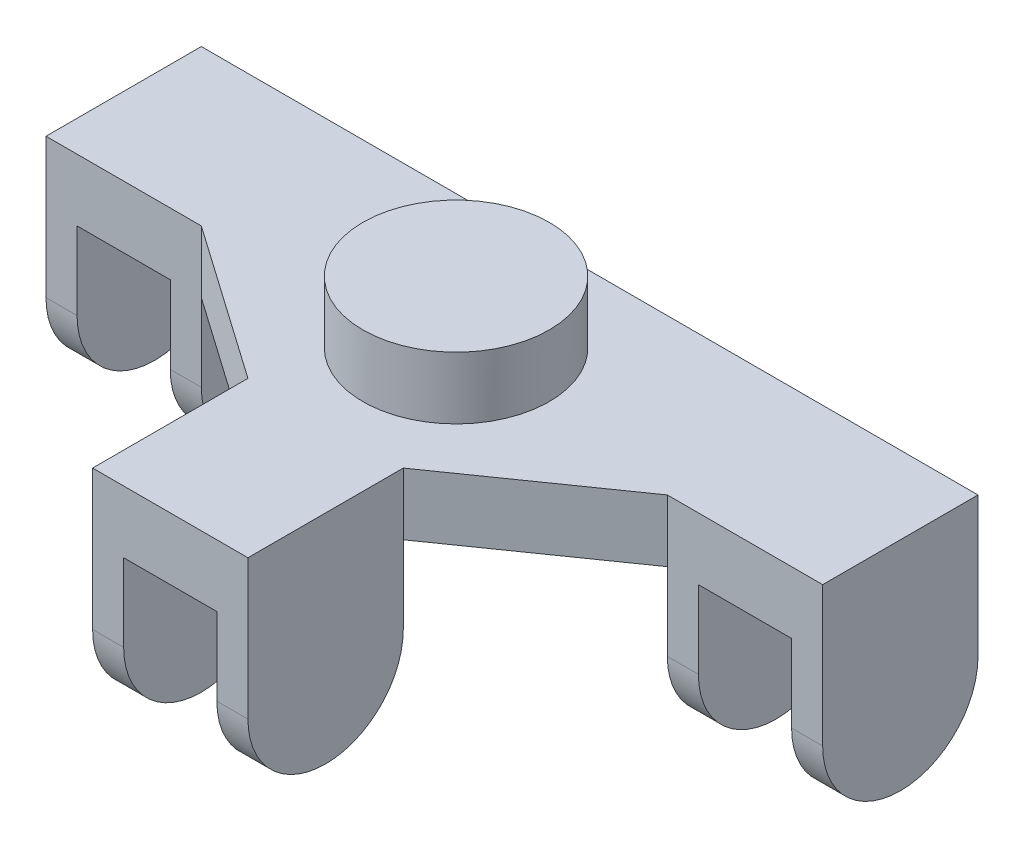
ISO-10303-21;
HEADER;
FILE_DESCRIPTION(('STEP AP214'),'2;1');
FILE_NAME('part.step','',(''),(''),'','','');
FILE_SCHEMA(('AUTOMOTIVE_DESIGN { 1 0 10303 214 1 1 1 1 }'));
ENDSEC;
DATA;
#1=APPLICATION_CONTEXT('core data for automotive mechanical design processes');
#2=APPLICATION_PROTOCOL_DEFINITION('international standard','automotive_design',2000,#1);
#3=PRODUCT_CONTEXT('',#1,'mechanical');
#4=PRODUCT('Part','Part','',(#3));
#5=PRODUCT_RELATED_PRODUCT_CATEGORY('part','',(#4));
#6=PRODUCT_DEFINITION_FORMATION('','',#4);
#7=PRODUCT_DEFINITION_CONTEXT('part definition',#1,'design');
#8=PRODUCT_DEFINITION('design','',#6,#7);
#9=PRODUCT_DEFINITION_SHAPE('','',#8);
#10=(LENGTH_UNIT() NAMED_UNIT(*) SI_UNIT(.MILLI.,.METRE.));
#11=(NAMED_UNIT(*) PLANE_ANGLE_UNIT() SI_UNIT($,.RADIAN.));
#12=(NAMED_UNIT(*) SI_UNIT($,.STERADIAN.) SOLID_ANGLE_UNIT());
#13=UNCERTAINTY_MEASURE_WITH_UNIT(LENGTH_MEASURE(1.E-05),#10,'distance_accuracy_value','');
#14=(GEOMETRIC_REPRESENTATION_CONTEXT(3) GLOBAL_UNCERTAINTY_ASSIGNED_CONTEXT((#13)) GLOBAL_UNIT_ASSIGNED_CONTEXT((#10,
#11,#12)) REPRESENTATION_CONTEXT('',''));
#15=CARTESIAN_POINT('',(0.,0.,0.));
#16=DIRECTION('',(0.,0.,1.));
#17=DIRECTION('',(1.,0.,0.));
#18=AXIS2_PLACEMENT_3D('',#15,#16,#17);
#19=CARTESIAN_POINT('',(-5.,-10.,12.));
#20=DIRECTION('',(0.,0.,-1.));
#21=DIRECTION('',(-1.,0.,0.));
#22=AXIS2_PLACEMENT_3D('',#19,#20,#21);
#23=PLANE('',#22);
#24=DIRECTION('',(0.,1.,0.));
#25=VECTOR('',#24,1.);
#26=CARTESIAN_POINT('',(5.,-10.,12.));
#27=LINE('',#26,#25);
#28=CARTESIAN_POINT('',(5.,-5.,12.));
#29=VERTEX_POINT('',#28);
#30=CARTESIAN_POINT('',(5.,0.,12.));
#31=VERTEX_POINT('',#30);
#32=EDGE_CURVE('E322',#29,#31,#27,.T.);
#33=ORIENTED_EDGE('',*,*,#32,.F.);
#34=DIRECTION('',(1.,0.,0.));
#35=VECTOR('',#34,1.);
#36=CARTESIAN_POINT('',(-25.,-5.,12.));
#37=LINE('',#36,#35);
#38=CARTESIAN_POINT('',(3.,-5.,12.));
#39=VERTEX_POINT('',#38);
#40=EDGE_CURVE('E286',#39,#29,#37,.T.);
#41=ORIENTED_EDGE('',*,*,#40,.F.);
#42=DIRECTION('',(0.,-1.,0.));
#43=VECTOR('',#42,1.);
#44=CARTESIAN_POINT('',(3.,-10.,12.));
#45=LINE('',#44,#43);
#46=CARTESIAN_POINT('',(3.,0.,12.));
#47=VERTEX_POINT('',#46);
#48=EDGE_CURVE('E292',#47,#39,#45,.T.);
#49=ORIENTED_EDGE('',*,*,#48,.F.);
#50=DIRECTION('',(-1.,0.,0.));
#51=VECTOR('',#50,1.);
#52=CARTESIAN_POINT('',(-5.,0.,12.));
#53=LINE('',#52,#51);
#54=EDGE_CURVE('E319',#31,#47,#53,.T.);
#55=ORIENTED_EDGE('',*,*,#54,.F.);
#56=EDGE_LOOP('',(#33,#41,#49,#55));
#57=FACE_BOUND('',#56,.T.);
#58=ADVANCED_FACE('F34',(#57),#23,.T.);
#59=CARTESIAN_POINT('',(-25.,4.,5.));
#60=DIRECTION('',(0.,0.,-1.));
#61=DIRECTION('',(-1.,0.,0.));
#62=AXIS2_PLACEMENT_3D('',#59,#60,#61);
#63=PLANE('',#62);
#64=DIRECTION('',(1.,0.,0.));
#65=VECTOR('',#64,1.);
#66=CARTESIAN_POINT('',(-25.,-5.,5.00000000000001));
#67=LINE('',#66,#65);
#68=CARTESIAN_POINT('',(-17.,-5.,5.));
#69=VERTEX_POINT('',#68);
#70=CARTESIAN_POINT('',(-15.,-5.,5.00000000000001));
#71=VERTEX_POINT('',#70);
#72=EDGE_CURVE('E217',#69,#71,#67,.T.);
#73=ORIENTED_EDGE('',*,*,#72,.T.);
#74=DIRECTION('',(0.,1.,0.));
#75=VECTOR('',#74,1.);
#76=CARTESIAN_POINT('',(-15.,-10.,5.));
#77=LINE('',#76,#75);
#78=CARTESIAN_POINT('',(-15.,0.,5.));
#79=VERTEX_POINT('',#78);
#80=EDGE_CURVE('E336',#71,#79,#77,.T.);
#81=ORIENTED_EDGE('',*,*,#80,.T.);
#82=DIRECTION('',(0.,-1.,0.));
#83=VECTOR('',#82,1.);
#84=CARTESIAN_POINT('',(-15.,4.,5.));
#85=LINE('',#84,#83);
#86=CARTESIAN_POINT('',(-15.,4.,5.));
#87=VERTEX_POINT('',#86);
#88=EDGE_CURVE('E264',#87,#79,#85,.T.);
#89=ORIENTED_EDGE('',*,*,#88,.F.);
#90=DIRECTION('',(1.,0.,0.));
#91=VECTOR('',#90,1.);
#92=CARTESIAN_POINT('',(-25.,4.,5.));
#93=LINE('',#92,#91);
#94=CARTESIAN_POINT('',(-25.,4.,5.));
#95=VERTEX_POINT('',#94);
#96=EDGE_CURVE('E233',#95,#87,#93,.T.);
#97=ORIENTED_EDGE('',*,*,#96,.F.);
#98=DIRECTION('',(0.,-1.,0.));
#99=VECTOR('',#98,1.);
#100=CARTESIAN_POINT('',(-25.,4.,5.));
#101=LINE('',#100,#99);
#102=CARTESIAN_POINT('',(-25.,-5.,5.00000000000001));
#103=VERTEX_POINT('',#102);
#104=EDGE_CURVE('E224',#95,#103,#101,.T.);
#105=ORIENTED_EDGE('',*,*,#104,.T.);
#106=CARTESIAN_POINT('',(-23.,-5.,5.00000000000001));
#107=VERTEX_POINT('',#106);
#108=EDGE_CURVE('E206',#103,#107,#67,.T.);
#109=ORIENTED_EDGE('',*,*,#108,.T.);
#110=DIRECTION('',(0.,1.,0.));
#111=VECTOR('',#110,1.);
#112=CARTESIAN_POINT('',(-23.,4.,5.));
#113=LINE('',#112,#111);
#114=CARTESIAN_POINT('',(-23.,0.,5.));
#115=VERTEX_POINT('',#114);
#116=EDGE_CURVE('E308',#107,#115,#113,.T.);
#117=ORIENTED_EDGE('',*,*,#116,.T.);
#118=DIRECTION('',(1.,0.,0.));
#119=VECTOR('',#118,1.);
#120=CARTESIAN_POINT('',(-25.,0.,5.));
#121=LINE('',#120,#119);
#122=CARTESIAN_POINT('',(-17.,0.,5.));
#123=VERTEX_POINT('',#122);
#124=EDGE_CURVE('E313',#115,#123,#121,.T.);
#125=ORIENTED_EDGE('',*,*,#124,.T.);
#126=DIRECTION('',(0.,-1.,0.));
#127=VECTOR('',#126,1.);
#128=CARTESIAN_POINT('',(-17.,4.,5.));
#129=LINE('',#128,#127);
#130=EDGE_CURVE('E310',#123,#69,#129,.T.);
#131=ORIENTED_EDGE('',*,*,#130,.T.);
#132=EDGE_LOOP('',(#73,#81,#89,#97,#105,#109,#117,#125,#131));
#133=FACE_BOUND('',#132,.T.);
#134=ADVANCED_FACE('F36',(#133),#63,.F.);
#135=CARTESIAN_POINT('',(-5.,4.,22.));
#136=DIRECTION('',(0.,0.,-1.));
#137=DIRECTION('',(-1.,0.,0.));
#138=AXIS2_PLACEMENT_3D('',#135,#136,#137);
#139=PLANE('',#138);
#140=DIRECTION('',(1.,0.,0.));
#141=VECTOR('',#140,1.);
#142=CARTESIAN_POINT('',(-25.,-5.,22.));
#143=LINE('',#142,#141);
#144=CARTESIAN_POINT('',(3.,-5.,22.));
#145=VERTEX_POINT('',#144);
#146=CARTESIAN_POINT('',(5.,-5.,22.));
#147=VERTEX_POINT('',#146);
#148=EDGE_CURVE('E49',#145,#147,#143,.T.);
#149=ORIENTED_EDGE('',*,*,#148,.T.);
#150=DIRECTION('',(0.,-1.,0.));
#151=VECTOR('',#150,1.);
#152=CARTESIAN_POINT('',(5.,4.,22.));
#153=LINE('',#152,#151);
#154=CARTESIAN_POINT('',(5.,4.,22.));
#155=VERTEX_POINT('',#154);
#156=EDGE_CURVE('E255',#155,#147,#153,.T.);
#157=ORIENTED_EDGE('',*,*,#156,.F.);
#158=DIRECTION('',(1.,0.,0.));
#159=VECTOR('',#158,1.);
#160=CARTESIAN_POINT('',(-5.,4.,22.));
#161=LINE('',#160,#159);
#162=CARTESIAN_POINT('',(-5.,4.,22.));
#163=VERTEX_POINT('',#162);
#164=EDGE_CURVE('E346',#163,#155,#161,.T.);
#165=ORIENTED_EDGE('',*,*,#164,.F.);
#166=DIRECTION('',(0.,-1.,0.));
#167=VECTOR('',#166,1.);
#168=CARTESIAN_POINT('',(-5.,4.,22.));
#169=LINE('',#168,#167);
#170=CARTESIAN_POINT('',(-5.,-5.,22.));
#171=VERTEX_POINT('',#170);
#172=EDGE_CURVE('E258',#163,#171,#169,.T.);
#173=ORIENTED_EDGE('',*,*,#172,.T.);
#174=CARTESIAN_POINT('',(-3.,-5.,22.));
#175=VERTEX_POINT('',#174);
#176=EDGE_CURVE('E505',#171,#175,#143,.T.);
#177=ORIENTED_EDGE('',*,*,#176,.T.);
#178=DIRECTION('',(0.,1.,0.));
#179=VECTOR('',#178,1.);
#180=CARTESIAN_POINT('',(-3.,0.,22.));
#181=LINE('',#180,#179);
#182=CARTESIAN_POINT('',(-3.,0.,22.));
#183=VERTEX_POINT('',#182);
#184=EDGE_CURVE('E275',#175,#183,#181,.T.);
#185=ORIENTED_EDGE('',*,*,#184,.T.);
#186=DIRECTION('',(1.,0.,0.));
#187=VECTOR('',#186,1.);
#188=CARTESIAN_POINT('',(3.,0.,22.));
#189=LINE('',#188,#187);
#190=CARTESIAN_POINT('',(3.,0.,22.));
#191=VERTEX_POINT('',#190);
#192=EDGE_CURVE('E410',#183,#191,#189,.T.);
#193=ORIENTED_EDGE('',*,*,#192,.T.);
#194=DIRECTION('',(0.,-1.,0.));
#195=VECTOR('',#194,1.);
#196=CARTESIAN_POINT('',(3.,0.,22.));
#197=LINE('',#196,#195);
#198=EDGE_CURVE('E405',#191,#145,#197,.T.);
#199=ORIENTED_EDGE('',*,*,#198,.T.);
#200=EDGE_LOOP('',(#149,#157,#165,#173,#177,#185,#193,#199));
#201=FACE_BOUND('',#200,.T.);
#202=ADVANCED_FACE('F457',(#201),#139,.F.);
#203=CARTESIAN_POINT('',(15.,4.,5.));
#204=DIRECTION('',(0.,0.,-1.));
#205=DIRECTION('',(-1.,0.,0.));
#206=AXIS2_PLACEMENT_3D('',#203,#204,#205);
#207=PLANE('',#206);
#208=CARTESIAN_POINT('',(23.,-5.,5.));
#209=VERTEX_POINT('',#208);
#210=CARTESIAN_POINT('',(25.,-5.,4.99999999999999));
#211=VERTEX_POINT('',#210);
#212=EDGE_CURVE('E57',#209,#211,#67,.T.);
#213=ORIENTED_EDGE('',*,*,#212,.T.);
#214=DIRECTION('',(0.,-1.,0.));
#215=VECTOR('',#214,1.);
#216=CARTESIAN_POINT('',(25.,4.,5.));
#217=LINE('',#216,#215);
#218=CARTESIAN_POINT('',(25.,4.,5.));
#219=VERTEX_POINT('',#218);
#220=EDGE_CURVE('E246',#219,#211,#217,.T.);
#221=ORIENTED_EDGE('',*,*,#220,.F.);
#222=DIRECTION('',(1.,0.,0.));
#223=VECTOR('',#222,1.);
#224=CARTESIAN_POINT('',(15.,4.,5.));
#225=LINE('',#224,#223);
#226=CARTESIAN_POINT('',(15.,4.,5.));
#227=VERTEX_POINT('',#226);
#228=EDGE_CURVE('E352',#227,#219,#225,.T.);
#229=ORIENTED_EDGE('',*,*,#228,.F.);
#230=DIRECTION('',(0.,-1.,0.));
#231=VECTOR('',#230,1.);
#232=CARTESIAN_POINT('',(15.,4.,5.));
#233=LINE('',#232,#231);
#234=CARTESIAN_POINT('',(15.,0.,5.));
#235=VERTEX_POINT('',#234);
#236=EDGE_CURVE('E249',#227,#235,#233,.T.);
#237=ORIENTED_EDGE('',*,*,#236,.T.);
#238=DIRECTION('',(0.,1.,0.));
#239=VECTOR('',#238,1.);
#240=CARTESIAN_POINT('',(15.,-10.,5.));
#241=LINE('',#240,#239);
#242=CARTESIAN_POINT('',(15.,-5.,4.99999999999999));
#243=VERTEX_POINT('',#242);
#244=EDGE_CURVE('E329',#243,#235,#241,.T.);
#245=ORIENTED_EDGE('',*,*,#244,.F.);
#246=CARTESIAN_POINT('',(17.,-5.,4.99999999999999));
#247=VERTEX_POINT('',#246);
#248=EDGE_CURVE('E527',#243,#247,#67,.T.);
#249=ORIENTED_EDGE('',*,*,#248,.T.);
#250=DIRECTION('',(0.,1.,0.));
#251=VECTOR('',#250,1.);
#252=CARTESIAN_POINT('',(17.,4.,5.));
#253=LINE('',#252,#251);
#254=CARTESIAN_POINT('',(17.,0.,5.));
#255=VERTEX_POINT('',#254);
#256=EDGE_CURVE('E296',#247,#255,#253,.T.);
#257=ORIENTED_EDGE('',*,*,#256,.T.);
#258=DIRECTION('',(1.,0.,0.));
#259=VECTOR('',#258,1.);
#260=CARTESIAN_POINT('',(15.,0.,5.));
#261=LINE('',#260,#259);
#262=CARTESIAN_POINT('',(23.,0.,5.));
#263=VERTEX_POINT('',#262);
#264=EDGE_CURVE('E316',#255,#263,#261,.T.);
#265=ORIENTED_EDGE('',*,*,#264,.T.);
#266=DIRECTION('',(0.,-1.,0.));
#267=VECTOR('',#266,1.);
#268=CARTESIAN_POINT('',(23.,4.,5.));
#269=LINE('',#268,#267);
#270=EDGE_CURVE('E305',#263,#209,#269,.T.);
#271=ORIENTED_EDGE('',*,*,#270,.T.);
#272=EDGE_LOOP('',(#213,#221,#229,#237,#245,#249,#257,#265,#271));
#273=FACE_BOUND('',#272,.T.);
#274=ADVANCED_FACE('F461',(#273),#207,.F.);
#275=DIRECTION('',(0.,1.,0.));
#276=VECTOR('',#275,1.);
#277=CARTESIAN_POINT('',(-3.,-10.,12.));
#278=LINE('',#277,#276);
#279=CARTESIAN_POINT('',(-3.,-5.,12.));
#280=VERTEX_POINT('',#279);
#281=CARTESIAN_POINT('',(-3.,0.,12.));
#282=VERTEX_POINT('',#281);
#283=EDGE_CURVE('E273',#280,#282,#278,.T.);
#284=ORIENTED_EDGE('',*,*,#283,.F.);
#285=CARTESIAN_POINT('',(-5.,-5.,12.));
#286=VERTEX_POINT('',#285);
#287=EDGE_CURVE('E280',#286,#280,#37,.T.);
#288=ORIENTED_EDGE('',*,*,#287,.F.);
#289=DIRECTION('',(0.,1.,0.));
#290=VECTOR('',#289,1.);
#291=CARTESIAN_POINT('',(-5.,-10.,12.));
#292=LINE('',#291,#290);
#293=CARTESIAN_POINT('',(-5.,0.,12.));
#294=VERTEX_POINT('',#293);
#295=EDGE_CURVE('E323',#286,#294,#292,.T.);
#296=ORIENTED_EDGE('',*,*,#295,.T.);
#297=EDGE_CURVE('E291',#282,#294,#53,.T.);
#298=ORIENTED_EDGE('',*,*,#297,.F.);
#299=EDGE_LOOP('',(#284,#288,#296,#298));
#300=FACE_BOUND('',#299,.T.);
#301=ADVANCED_FACE('F289',(#300),#23,.T.);
#302=CARTESIAN_POINT('',(0.,0.,0.));
#303=DIRECTION('',(0.,-1.,0.));
#304=DIRECTION('',(0.,0.,-1.));
#305=AXIS2_PLACEMENT_3D('',#302,#303,#304);
#306=PLANE('',#305);
#307=DIRECTION('',(0.,0.,-1.));
#308=VECTOR('',#307,1.);
#309=CARTESIAN_POINT('',(-15.,0.,-5.));
#310=LINE('',#309,#308);
#311=CARTESIAN_POINT('',(-15.,0.,-5.));
#312=VERTEX_POINT('',#311);
#313=EDGE_CURVE('E332',#79,#312,#310,.T.);
#314=ORIENTED_EDGE('',*,*,#313,.T.);
#315=DIRECTION('',(-1.,0.,0.));
#316=VECTOR('',#315,1.);
#317=CARTESIAN_POINT('',(25.,0.,-5.));
#318=LINE('',#317,#316);
#319=CARTESIAN_POINT('',(15.,0.,-5.));
#320=VERTEX_POINT('',#319);
#321=EDGE_CURVE('E241',#320,#312,#318,.T.);
#322=ORIENTED_EDGE('',*,*,#321,.F.);
#323=DIRECTION('',(0.,0.,1.));
#324=VECTOR('',#323,1.);
#325=CARTESIAN_POINT('',(15.,0.,-5.));
#326=LINE('',#325,#324);
#327=EDGE_CURVE('E325',#320,#235,#326,.T.);
#328=ORIENTED_EDGE('',*,*,#327,.T.);
#329=DIRECTION('',(0.81923192051904,0.,-0.573462344363329));
#330=VECTOR('',#329,1.);
#331=CARTESIAN_POINT('',(5.,0.,12.));
#332=LINE('',#331,#330);
#333=EDGE_CURVE('E358',#31,#235,#332,.T.);
#334=ORIENTED_EDGE('',*,*,#333,.F.);
#335=ORIENTED_EDGE('',*,*,#54,.T.);
#336=DIRECTION('',(0.,0.,-1.));
#337=VECTOR('',#336,1.);
#338=CARTESIAN_POINT('',(3.,0.,22.));
#339=LINE('',#338,#337);
#340=EDGE_CURVE('E398',#191,#47,#339,.T.);
#341=ORIENTED_EDGE('',*,*,#340,.F.);
#342=ORIENTED_EDGE('',*,*,#192,.F.);
#343=DIRECTION('',(0.,0.,-1.));
#344=VECTOR('',#343,1.);
#345=CARTESIAN_POINT('',(-3.,0.,22.));
#346=LINE('',#345,#344);
#347=EDGE_CURVE('E413',#183,#282,#346,.T.);
#348=ORIENTED_EDGE('',*,*,#347,.T.);
#349=ORIENTED_EDGE('',*,*,#297,.T.);
#350=DIRECTION('',(0.81923192051904,0.,0.573462344363328));
#351=VECTOR('',#350,1.);
#352=CARTESIAN_POINT('',(-15.,0.,5.));
#353=LINE('',#352,#351);
#354=EDGE_CURVE('E339',#79,#294,#353,.T.);
#355=ORIENTED_EDGE('',*,*,#354,.F.);
#356=EDGE_LOOP('',(#314,#322,#328,#334,#335,#341,#342,#348,#349,#355));
#357=FACE_BOUND('',#356,.T.);
#358=ADVANCED_FACE('F375',(#357),#306,.T.);
#359=CARTESIAN_POINT('',(-15.,4.,5.));
#360=DIRECTION('',(0.573462344363329,0.,-0.81923192051904));
#361=DIRECTION('',(-0.81923192051904,0.,-0.573462344363329));
#362=AXIS2_PLACEMENT_3D('',#359,#360,#361);
#363=PLANE('',#362);
#364=ORIENTED_EDGE('',*,*,#354,.T.);
#365=DIRECTION('',(0.,-1.,0.));
#366=VECTOR('',#365,1.);
#367=CARTESIAN_POINT('',(-5.,4.,12.));
#368=LINE('',#367,#366);
#369=CARTESIAN_POINT('',(-5.,4.,12.));
#370=VERTEX_POINT('',#369);
#371=EDGE_CURVE('E261',#370,#294,#368,.T.);
#372=ORIENTED_EDGE('',*,*,#371,.F.);
#373=DIRECTION('',(0.81923192051904,0.,0.573462344363328));
#374=VECTOR('',#373,1.);
#375=CARTESIAN_POINT('',(-15.,4.,5.));
#376=LINE('',#375,#374);
#377=EDGE_CURVE('E342',#87,#370,#376,.T.);
#378=ORIENTED_EDGE('',*,*,#377,.F.);
#379=ORIENTED_EDGE('',*,*,#88,.T.);
#380=EDGE_LOOP('',(#364,#372,#378,#379));
#381=FACE_BOUND('',#380,.T.);
#382=ADVANCED_FACE('F466',(#381),#363,.F.);
#383=CARTESIAN_POINT('',(-5.,4.,12.));
#384=DIRECTION('',(1.,0.,0.));
#385=DIRECTION('',(0.,0.,-1.));
#386=AXIS2_PLACEMENT_3D('',#383,#384,#385);
#387=PLANE('',#386);
#388=ORIENTED_EDGE('',*,*,#295,.F.);
#389=CARTESIAN_POINT('',(-5.,-5.,17.));
#390=DIRECTION('',(1.,0.,0.));
#391=DIRECTION('',(0.,0.,-1.));
#392=AXIS2_PLACEMENT_3D('',#389,#390,#391);
#393=CIRCLE('',#392,5.);
#394=EDGE_CURVE('E282',#286,#171,#393,.F.);
#395=ORIENTED_EDGE('',*,*,#394,.T.);
#396=ORIENTED_EDGE('',*,*,#172,.F.);
#397=DIRECTION('',(0.,0.,1.));
#398=VECTOR('',#397,1.);
#399=CARTESIAN_POINT('',(-5.,4.,12.));
#400=LINE('',#399,#398);
#401=EDGE_CURVE('E344',#370,#163,#400,.T.);
#402=ORIENTED_EDGE('',*,*,#401,.F.);
#403=ORIENTED_EDGE('',*,*,#371,.T.);
#404=EDGE_LOOP('',(#388,#395,#396,#402,#403));
#405=FACE_BOUND('',#404,.T.);
#406=ADVANCED_FACE('F484',(#405),#387,.F.);
#407=CARTESIAN_POINT('',(5.,4.,22.));
#408=DIRECTION('',(-1.,0.,0.));
#409=DIRECTION('',(0.,0.,1.));
#410=AXIS2_PLACEMENT_3D('',#407,#408,#409);
#411=PLANE('',#410);
#412=ORIENTED_EDGE('',*,*,#156,.T.);
#413=CARTESIAN_POINT('',(5.,-5.,17.));
#414=DIRECTION('',(-1.,0.,0.));
#415=DIRECTION('',(0.,0.,1.));
#416=AXIS2_PLACEMENT_3D('',#413,#414,#415);
#417=CIRCLE('',#416,5.);
#418=EDGE_CURVE('E385',#147,#29,#417,.F.);
#419=ORIENTED_EDGE('',*,*,#418,.T.);
#420=ORIENTED_EDGE('',*,*,#32,.T.);
#421=DIRECTION('',(0.,-1.,0.));
#422=VECTOR('',#421,1.);
#423=CARTESIAN_POINT('',(5.,4.,12.));
#424=LINE('',#423,#422);
#425=CARTESIAN_POINT('',(5.,4.,12.));
#426=VERTEX_POINT('',#425);
#427=EDGE_CURVE('E252',#426,#31,#424,.T.);
#428=ORIENTED_EDGE('',*,*,#427,.F.);
#429=DIRECTION('',(0.,0.,-1.));
#430=VECTOR('',#429,1.);
#431=CARTESIAN_POINT('',(5.,4.,22.));
#432=LINE('',#431,#430);
#433=EDGE_CURVE('E348',#155,#426,#432,.T.);
#434=ORIENTED_EDGE('',*,*,#433,.F.);
#435=EDGE_LOOP('',(#412,#419,#420,#428,#434));
#436=FACE_BOUND('',#435,.T.);
#437=ADVANCED_FACE('F482',(#436),#411,.F.);
#438=CARTESIAN_POINT('',(5.,4.,12.));
#439=DIRECTION('',(-0.573462344363329,0.,-0.81923192051904));
#440=DIRECTION('',(-0.81923192051904,0.,0.573462344363329));
#441=AXIS2_PLACEMENT_3D('',#438,#439,#440);
#442=PLANE('',#441);
#443=ORIENTED_EDGE('',*,*,#333,.T.);
#444=ORIENTED_EDGE('',*,*,#236,.F.);
#445=DIRECTION('',(0.81923192051904,0.,-0.573462344363329));
#446=VECTOR('',#445,1.);
#447=CARTESIAN_POINT('',(5.,4.,12.));
#448=LINE('',#447,#446);
#449=EDGE_CURVE('E350',#426,#227,#448,.T.);
#450=ORIENTED_EDGE('',*,*,#449,.F.);
#451=ORIENTED_EDGE('',*,*,#427,.T.);
#452=EDGE_LOOP('',(#443,#444,#450,#451));
#453=FACE_BOUND('',#452,.T.);
#454=ADVANCED_FACE('F479',(#453),#442,.F.);
#455=CARTESIAN_POINT('',(25.,4.,5.));
#456=DIRECTION('',(-1.,0.,0.));
#457=DIRECTION('',(0.,0.,1.));
#458=AXIS2_PLACEMENT_3D('',#455,#456,#457);
#459=PLANE('',#458);
#460=ORIENTED_EDGE('',*,*,#220,.T.);
#461=CARTESIAN_POINT('',(25.,-5.,0.));
#462=DIRECTION('',(-1.,0.,0.));
#463=DIRECTION('',(0.,0.,-1.));
#464=AXIS2_PLACEMENT_3D('',#461,#462,#463);
#465=CIRCLE('',#464,5.);
#466=CARTESIAN_POINT('',(25.,-5.,-5.00000000000001));
#467=VERTEX_POINT('',#466);
#468=EDGE_CURVE('E228',#467,#211,#465,.T.);
#469=ORIENTED_EDGE('',*,*,#468,.F.);
#470=DIRECTION('',(0.,-1.,0.));
#471=VECTOR('',#470,1.);
#472=CARTESIAN_POINT('',(25.,4.,-5.));
#473=LINE('',#472,#471);
#474=CARTESIAN_POINT('',(25.,4.,-5.));
#475=VERTEX_POINT('',#474);
#476=EDGE_CURVE('E236',#475,#467,#473,.T.);
#477=ORIENTED_EDGE('',*,*,#476,.F.);
#478=DIRECTION('',(0.,0.,-1.));
#479=VECTOR('',#478,1.);
#480=CARTESIAN_POINT('',(25.,4.,5.));
#481=LINE('',#480,#479);
#482=EDGE_CURVE('E354',#219,#475,#481,.T.);
#483=ORIENTED_EDGE('',*,*,#482,.F.);
#484=EDGE_LOOP('',(#460,#469,#477,#483));
#485=FACE_BOUND('',#484,.T.);
#486=ADVANCED_FACE('F477',(#485),#459,.F.);
#487=CARTESIAN_POINT('',(25.,4.,-5.));
#488=DIRECTION('',(0.,0.,1.));
#489=DIRECTION('',(1.,0.,0.));
#490=AXIS2_PLACEMENT_3D('',#487,#488,#489);
#491=PLANE('',#490);
#492=ORIENTED_EDGE('',*,*,#476,.T.);
#493=DIRECTION('',(1.,0.,0.));
#494=VECTOR('',#493,1.);
#495=CARTESIAN_POINT('',(-25.,-5.,-4.99999999999999));
#496=LINE('',#495,#494);
#497=CARTESIAN_POINT('',(23.,-5.,-5.00000000000001));
#498=VERTEX_POINT('',#497);
#499=EDGE_CURVE('E216',#498,#467,#496,.T.);
#500=ORIENTED_EDGE('',*,*,#499,.F.);
#501=DIRECTION('',(0.,-1.,0.));
#502=VECTOR('',#501,1.);
#503=CARTESIAN_POINT('',(23.,0.,-5.));
#504=LINE('',#503,#502);
#505=CARTESIAN_POINT('',(23.,0.,-5.));
#506=VERTEX_POINT('',#505);
#507=EDGE_CURVE('E394',#506,#498,#504,.T.);
#508=ORIENTED_EDGE('',*,*,#507,.F.);
#509=DIRECTION('',(1.,0.,0.));
#510=VECTOR('',#509,1.);
#511=CARTESIAN_POINT('',(23.,0.,-5.));
#512=LINE('',#511,#510);
#513=CARTESIAN_POINT('',(17.,0.,-5.));
#514=VERTEX_POINT('',#513);
#515=EDGE_CURVE('E400',#514,#506,#512,.T.);
#516=ORIENTED_EDGE('',*,*,#515,.F.);
#517=DIRECTION('',(0.,1.,0.));
#518=VECTOR('',#517,1.);
#519=CARTESIAN_POINT('',(17.,0.,-5.));
#520=LINE('',#519,#518);
#521=CARTESIAN_POINT('',(17.,-5.,-5.));
#522=VERTEX_POINT('',#521);
#523=EDGE_CURVE('E397',#522,#514,#520,.T.);
#524=ORIENTED_EDGE('',*,*,#523,.F.);
#525=CARTESIAN_POINT('',(15.,-5.,-5.00000000000001));
#526=VERTEX_POINT('',#525);
#527=EDGE_CURVE('E507',#526,#522,#496,.T.);
#528=ORIENTED_EDGE('',*,*,#527,.F.);
#529=DIRECTION('',(0.,1.,0.));
#530=VECTOR('',#529,1.);
#531=CARTESIAN_POINT('',(15.,-10.,-5.));
#532=LINE('',#531,#530);
#533=EDGE_CURVE('E330',#526,#320,#532,.T.);
#534=ORIENTED_EDGE('',*,*,#533,.T.);
#535=ORIENTED_EDGE('',*,*,#321,.T.);
#536=DIRECTION('',(0.,1.,0.));
#537=VECTOR('',#536,1.);
#538=CARTESIAN_POINT('',(-15.,-10.,-5.));
#539=LINE('',#538,#537);
#540=CARTESIAN_POINT('',(-15.,-5.,-4.99999999999999));
#541=VERTEX_POINT('',#540);
#542=EDGE_CURVE('E337',#541,#312,#539,.T.);
#543=ORIENTED_EDGE('',*,*,#542,.F.);
#544=CARTESIAN_POINT('',(-17.,-5.,-4.99999999999999));
#545=VERTEX_POINT('',#544);
#546=EDGE_CURVE('E433',#545,#541,#496,.T.);
#547=ORIENTED_EDGE('',*,*,#546,.F.);
#548=DIRECTION('',(0.,-1.,0.));
#549=VECTOR('',#548,1.);
#550=CARTESIAN_POINT('',(-17.,0.,-5.));
#551=LINE('',#550,#549);
#552=CARTESIAN_POINT('',(-17.,0.,-5.));
#553=VERTEX_POINT('',#552);
#554=EDGE_CURVE('E392',#553,#545,#551,.T.);
#555=ORIENTED_EDGE('',*,*,#554,.F.);
#556=DIRECTION('',(1.,0.,0.));
#557=VECTOR('',#556,1.);
#558=CARTESIAN_POINT('',(-17.,0.,-5.));
#559=LINE('',#558,#557);
#560=CARTESIAN_POINT('',(-23.,0.,-5.));
#561=VERTEX_POINT('',#560);
#562=EDGE_CURVE('E420',#561,#553,#559,.T.);
#563=ORIENTED_EDGE('',*,*,#562,.F.);
#564=DIRECTION('',(0.,1.,0.));
#565=VECTOR('',#564,1.);
#566=CARTESIAN_POINT('',(-23.,0.,-5.));
#567=LINE('',#566,#565);
#568=CARTESIAN_POINT('',(-23.,-5.,-5.));
#569=VERTEX_POINT('',#568);
#570=EDGE_CURVE('E418',#569,#561,#567,.T.);
#571=ORIENTED_EDGE('',*,*,#570,.F.);
#572=CARTESIAN_POINT('',(-25.,-5.,-4.99999999999999));
#573=VERTEX_POINT('',#572);
#574=EDGE_CURVE('E503',#573,#569,#496,.T.);
#575=ORIENTED_EDGE('',*,*,#574,.F.);
#576=DIRECTION('',(0.,-1.,0.));
#577=VECTOR('',#576,1.);
#578=CARTESIAN_POINT('',(-25.,4.,-5.));
#579=LINE('',#578,#577);
#580=CARTESIAN_POINT('',(-25.,4.,-5.));
#581=VERTEX_POINT('',#580);
#582=EDGE_CURVE('E227',#581,#573,#579,.T.);
#583=ORIENTED_EDGE('',*,*,#582,.F.);
#584=DIRECTION('',(-1.,0.,0.));
#585=VECTOR('',#584,1.);
#586=CARTESIAN_POINT('',(25.,4.,-5.));
#587=LINE('',#586,#585);
#588=EDGE_CURVE('E238',#475,#581,#587,.T.);
#589=ORIENTED_EDGE('',*,*,#588,.F.);
#590=EDGE_LOOP('',(#492,#500,#508,#516,#524,#528,#534,#535,#543,#547,#555,#563,#571,#575,#583,#589));
#591=FACE_BOUND('',#590,.T.);
#592=ADVANCED_FACE('F367',(#591),#491,.F.);
#593=CARTESIAN_POINT('',(-25.,4.,-5.));
#594=DIRECTION('',(1.,0.,0.));
#595=DIRECTION('',(0.,0.,-1.));
#596=AXIS2_PLACEMENT_3D('',#593,#594,#595);
#597=PLANE('',#596);
#598=ORIENTED_EDGE('',*,*,#582,.T.);
#599=CARTESIAN_POINT('',(-25.,-5.,0.));
#600=DIRECTION('',(-1.,0.,0.));
#601=DIRECTION('',(0.,0.,-1.));
#602=AXIS2_PLACEMENT_3D('',#599,#600,#601);
#603=CIRCLE('',#602,5.);
#604=EDGE_CURVE('E209',#573,#103,#603,.T.);
#605=ORIENTED_EDGE('',*,*,#604,.T.);
#606=ORIENTED_EDGE('',*,*,#104,.F.);
#607=DIRECTION('',(0.,0.,1.));
#608=VECTOR('',#607,1.);
#609=CARTESIAN_POINT('',(-25.,4.,-5.));
#610=LINE('',#609,#608);
#611=EDGE_CURVE('E234',#581,#95,#610,.T.);
#612=ORIENTED_EDGE('',*,*,#611,.F.);
#613=EDGE_LOOP('',(#598,#605,#606,#612));
#614=FACE_BOUND('',#613,.T.);
#615=ADVANCED_FACE('F222',(#614),#597,.F.);
#616=CARTESIAN_POINT('',(0.,4.,0.));
#617=DIRECTION('',(0.,-1.,0.));
#618=DIRECTION('',(0.,0.,-1.));
#619=AXIS2_PLACEMENT_3D('',#616,#617,#618);
#620=PLANE('',#619);
#621=CARTESIAN_POINT('',(0.,4.,3.6));
#622=DIRECTION('',(0.,-1.,0.));
#623=DIRECTION('',(0.,0.,-1.));
#624=AXIS2_PLACEMENT_3D('',#621,#622,#623);
#625=CIRCLE('',#624,6.);
#626=CARTESIAN_POINT('',(0.,4.,-2.4));
#627=VERTEX_POINT('',#626);
#628=EDGE_CURVE('E11',#627,#627,#625,.F.);
#629=ORIENTED_EDGE('',*,*,#628,.F.);
#630=EDGE_LOOP('',(#629));
#631=FACE_BOUND('',#630,.T.);
#632=ORIENTED_EDGE('',*,*,#96,.T.);
#633=ORIENTED_EDGE('',*,*,#377,.T.);
#634=ORIENTED_EDGE('',*,*,#401,.T.);
#635=ORIENTED_EDGE('',*,*,#164,.T.);
#636=ORIENTED_EDGE('',*,*,#433,.T.);
#637=ORIENTED_EDGE('',*,*,#449,.T.);
#638=ORIENTED_EDGE('',*,*,#228,.T.);
#639=ORIENTED_EDGE('',*,*,#482,.T.);
#640=ORIENTED_EDGE('',*,*,#588,.T.);
#641=ORIENTED_EDGE('',*,*,#611,.T.);
#642=EDGE_LOOP('',(#632,#633,#634,#635,#636,#637,#638,#639,#640,#641));
#643=FACE_BOUND('',#642,.T.);
#644=ADVANCED_FACE('F498',(#631,#643),#620,.F.);
#645=CARTESIAN_POINT('',(-15.,-10.,-5.));
#646=DIRECTION('',(1.,0.,0.));
#647=DIRECTION('',(0.,0.,-1.));
#648=AXIS2_PLACEMENT_3D('',#645,#646,#647);
#649=PLANE('',#648);
#650=CARTESIAN_POINT('',(-15.,-5.,0.));
#651=DIRECTION('',(1.,0.,0.));
#652=DIRECTION('',(0.,0.,-1.));
#653=AXIS2_PLACEMENT_3D('',#650,#651,#652);
#654=CIRCLE('',#653,5.);
#655=EDGE_CURVE('E380',#541,#71,#654,.F.);
#656=ORIENTED_EDGE('',*,*,#655,.F.);
#657=ORIENTED_EDGE('',*,*,#542,.T.);
#658=ORIENTED_EDGE('',*,*,#313,.F.);
#659=ORIENTED_EDGE('',*,*,#80,.F.);
#660=EDGE_LOOP('',(#656,#657,#658,#659));
#661=FACE_BOUND('',#660,.T.);
#662=ADVANCED_FACE('F379',(#661),#649,.T.);
#663=CARTESIAN_POINT('',(15.,-10.,-5.));
#664=DIRECTION('',(-1.,0.,0.));
#665=DIRECTION('',(0.,0.,1.));
#666=AXIS2_PLACEMENT_3D('',#663,#664,#665);
#667=PLANE('',#666);
#668=CARTESIAN_POINT('',(15.,-5.,0.));
#669=DIRECTION('',(-1.,0.,0.));
#670=DIRECTION('',(0.,0.,1.));
#671=AXIS2_PLACEMENT_3D('',#668,#669,#670);
#672=CIRCLE('',#671,5.);
#673=EDGE_CURVE('E383',#243,#526,#672,.F.);
#674=ORIENTED_EDGE('',*,*,#673,.F.);
#675=ORIENTED_EDGE('',*,*,#244,.T.);
#676=ORIENTED_EDGE('',*,*,#327,.F.);
#677=ORIENTED_EDGE('',*,*,#533,.F.);
#678=EDGE_LOOP('',(#674,#675,#676,#677));
#679=FACE_BOUND('',#678,.T.);
#680=ADVANCED_FACE('F544',(#679),#667,.T.);
#681=CARTESIAN_POINT('',(3.,0.,22.));
#682=DIRECTION('',(1.,0.,0.));
#683=DIRECTION('',(0.,1.,0.));
#684=AXIS2_PLACEMENT_3D('',#681,#682,#683);
#685=PLANE('',#684);
#686=ORIENTED_EDGE('',*,*,#48,.T.);
#687=CARTESIAN_POINT('',(3.,-5.,17.));
#688=DIRECTION('',(1.,0.,0.));
#689=DIRECTION('',(0.,1.,0.));
#690=AXIS2_PLACEMENT_3D('',#687,#688,#689);
#691=CIRCLE('',#690,5.);
#692=EDGE_CURVE('E382',#39,#145,#691,.F.);
#693=ORIENTED_EDGE('',*,*,#692,.T.);
#694=ORIENTED_EDGE('',*,*,#198,.F.);
#695=ORIENTED_EDGE('',*,*,#340,.T.);
#696=EDGE_LOOP('',(#686,#693,#694,#695));
#697=FACE_BOUND('',#696,.T.);
#698=ADVANCED_FACE('F546',(#697),#685,.F.);
#699=CARTESIAN_POINT('',(-3.,0.,22.));
#700=DIRECTION('',(-1.,0.,0.));
#701=DIRECTION('',(0.,-1.,0.));
#702=AXIS2_PLACEMENT_3D('',#699,#700,#701);
#703=PLANE('',#702);
#704=CARTESIAN_POINT('',(-3.,-5.,17.));
#705=DIRECTION('',(-1.,0.,0.));
#706=DIRECTION('',(0.,-1.,0.));
#707=AXIS2_PLACEMENT_3D('',#704,#705,#706);
#708=CIRCLE('',#707,5.);
#709=EDGE_CURVE('E42',#175,#280,#708,.F.);
#710=ORIENTED_EDGE('',*,*,#709,.T.);
#711=ORIENTED_EDGE('',*,*,#283,.T.);
#712=ORIENTED_EDGE('',*,*,#347,.F.);
#713=ORIENTED_EDGE('',*,*,#184,.F.);
#714=EDGE_LOOP('',(#710,#711,#712,#713));
#715=FACE_BOUND('',#714,.T.);
#716=ADVANCED_FACE('F270',(#715),#703,.F.);
#717=CARTESIAN_POINT('',(23.,0.,22.));
#718=DIRECTION('',(0.,1.,0.));
#719=DIRECTION('',(0.,0.,1.));
#720=AXIS2_PLACEMENT_3D('',#717,#718,#719);
#721=PLANE('',#720);
#722=DIRECTION('',(0.,0.,-1.));
#723=VECTOR('',#722,1.);
#724=CARTESIAN_POINT('',(17.,0.,22.));
#725=LINE('',#724,#723);
#726=EDGE_CURVE('E298',#255,#514,#725,.T.);
#727=ORIENTED_EDGE('',*,*,#726,.T.);
#728=ORIENTED_EDGE('',*,*,#515,.T.);
#729=DIRECTION('',(0.,0.,-1.));
#730=VECTOR('',#729,1.);
#731=CARTESIAN_POINT('',(23.,0.,22.));
#732=LINE('',#731,#730);
#733=EDGE_CURVE('E293',#263,#506,#732,.T.);
#734=ORIENTED_EDGE('',*,*,#733,.F.);
#735=ORIENTED_EDGE('',*,*,#264,.F.);
#736=EDGE_LOOP('',(#727,#728,#734,#735));
#737=FACE_BOUND('',#736,.T.);
#738=ADVANCED_FACE('F524',(#737),#721,.F.);
#739=CARTESIAN_POINT('',(23.,0.,22.));
#740=DIRECTION('',(1.,0.,0.));
#741=DIRECTION('',(0.,0.,-1.));
#742=AXIS2_PLACEMENT_3D('',#739,#740,#741);
#743=PLANE('',#742);
#744=ORIENTED_EDGE('',*,*,#507,.T.);
#745=CARTESIAN_POINT('',(23.,-5.,0.));
#746=DIRECTION('',(1.,0.,0.));
#747=DIRECTION('',(0.,0.,-1.));
#748=AXIS2_PLACEMENT_3D('',#745,#746,#747);
#749=CIRCLE('',#748,5.);
#750=EDGE_CURVE('E387',#498,#209,#749,.F.);
#751=ORIENTED_EDGE('',*,*,#750,.T.);
#752=ORIENTED_EDGE('',*,*,#270,.F.);
#753=ORIENTED_EDGE('',*,*,#733,.T.);
#754=EDGE_LOOP('',(#744,#751,#752,#753));
#755=FACE_BOUND('',#754,.T.);
#756=ADVANCED_FACE('F530',(#755),#743,.F.);
#757=CARTESIAN_POINT('',(17.,0.,22.));
#758=DIRECTION('',(-1.,0.,0.));
#759=DIRECTION('',(0.,0.,1.));
#760=AXIS2_PLACEMENT_3D('',#757,#758,#759);
#761=PLANE('',#760);
#762=ORIENTED_EDGE('',*,*,#256,.F.);
#763=CARTESIAN_POINT('',(17.,-5.,0.));
#764=DIRECTION('',(-1.,0.,0.));
#765=DIRECTION('',(0.,0.,1.));
#766=AXIS2_PLACEMENT_3D('',#763,#764,#765);
#767=CIRCLE('',#766,5.);
#768=EDGE_CURVE('E436',#247,#522,#767,.F.);
#769=ORIENTED_EDGE('',*,*,#768,.T.);
#770=ORIENTED_EDGE('',*,*,#523,.T.);
#771=ORIENTED_EDGE('',*,*,#726,.F.);
#772=EDGE_LOOP('',(#762,#769,#770,#771));
#773=FACE_BOUND('',#772,.T.);
#774=ADVANCED_FACE('F521',(#773),#761,.F.);
#775=CARTESIAN_POINT('',(-17.,0.,22.));
#776=DIRECTION('',(0.,1.,0.));
#777=DIRECTION('',(0.,0.,1.));
#778=AXIS2_PLACEMENT_3D('',#775,#776,#777);
#779=PLANE('',#778);
#780=DIRECTION('',(0.,0.,-1.));
#781=VECTOR('',#780,1.);
#782=CARTESIAN_POINT('',(-23.,0.,22.));
#783=LINE('',#782,#781);
#784=EDGE_CURVE('E301',#115,#561,#783,.T.);
#785=ORIENTED_EDGE('',*,*,#784,.T.);
#786=ORIENTED_EDGE('',*,*,#562,.T.);
#787=DIRECTION('',(0.,0.,-1.));
#788=VECTOR('',#787,1.);
#789=CARTESIAN_POINT('',(-17.,0.,22.));
#790=LINE('',#789,#788);
#791=EDGE_CURVE('E408',#123,#553,#790,.T.);
#792=ORIENTED_EDGE('',*,*,#791,.F.);
#793=ORIENTED_EDGE('',*,*,#124,.F.);
#794=EDGE_LOOP('',(#785,#786,#792,#793));
#795=FACE_BOUND('',#794,.T.);
#796=ADVANCED_FACE('F429',(#795),#779,.F.);
#797=CARTESIAN_POINT('',(-17.,0.,22.));
#798=DIRECTION('',(1.,0.,0.));
#799=DIRECTION('',(0.,0.,-1.));
#800=AXIS2_PLACEMENT_3D('',#797,#798,#799);
#801=PLANE('',#800);
#802=ORIENTED_EDGE('',*,*,#554,.T.);
#803=CARTESIAN_POINT('',(-17.,-5.,0.));
#804=DIRECTION('',(1.,0.,0.));
#805=DIRECTION('',(0.,0.,-1.));
#806=AXIS2_PLACEMENT_3D('',#803,#804,#805);
#807=CIRCLE('',#806,5.);
#808=EDGE_CURVE('E285',#545,#69,#807,.F.);
#809=ORIENTED_EDGE('',*,*,#808,.T.);
#810=ORIENTED_EDGE('',*,*,#130,.F.);
#811=ORIENTED_EDGE('',*,*,#791,.T.);
#812=EDGE_LOOP('',(#802,#809,#810,#811));
#813=FACE_BOUND('',#812,.T.);
#814=ADVANCED_FACE('F435',(#813),#801,.F.);
#815=CARTESIAN_POINT('',(-23.,0.,22.));
#816=DIRECTION('',(-1.,0.,0.));
#817=DIRECTION('',(0.,0.,1.));
#818=AXIS2_PLACEMENT_3D('',#815,#816,#817);
#819=PLANE('',#818);
#820=ORIENTED_EDGE('',*,*,#116,.F.);
#821=CARTESIAN_POINT('',(-23.,-5.,0.));
#822=DIRECTION('',(-1.,0.,0.));
#823=DIRECTION('',(0.,0.,1.));
#824=AXIS2_PLACEMENT_3D('',#821,#822,#823);
#825=CIRCLE('',#824,5.);
#826=EDGE_CURVE('E212',#107,#569,#825,.F.);
#827=ORIENTED_EDGE('',*,*,#826,.T.);
#828=ORIENTED_EDGE('',*,*,#570,.T.);
#829=ORIENTED_EDGE('',*,*,#784,.F.);
#830=EDGE_LOOP('',(#820,#827,#828,#829));
#831=FACE_BOUND('',#830,.T.);
#832=ADVANCED_FACE('F438',(#831),#819,.F.);
#833=CARTESIAN_POINT('',(-25.,-5.,0.));
#834=DIRECTION('',(1.,0.,0.));
#835=DIRECTION('',(0.,0.,-1.));
#836=AXIS2_PLACEMENT_3D('',#833,#834,#835);
#837=CYLINDRICAL_SURFACE('',#836,5.);
#838=ORIENTED_EDGE('',*,*,#826,.F.);
#839=ORIENTED_EDGE('',*,*,#108,.F.);
#840=ORIENTED_EDGE('',*,*,#604,.F.);
#841=ORIENTED_EDGE('',*,*,#574,.T.);
#842=EDGE_LOOP('',(#838,#839,#840,#841));
#843=FACE_BOUND('',#842,.T.);
#844=ADVANCED_FACE('F208',(#843),#837,.T.);
#845=ORIENTED_EDGE('',*,*,#655,.T.);
#846=ORIENTED_EDGE('',*,*,#72,.F.);
#847=ORIENTED_EDGE('',*,*,#808,.F.);
#848=ORIENTED_EDGE('',*,*,#546,.T.);
#849=EDGE_LOOP('',(#845,#846,#847,#848));
#850=FACE_BOUND('',#849,.T.);
#851=ADVANCED_FACE('F445',(#850),#837,.T.);
#852=ORIENTED_EDGE('',*,*,#673,.T.);
#853=ORIENTED_EDGE('',*,*,#527,.T.);
#854=ORIENTED_EDGE('',*,*,#768,.F.);
#855=ORIENTED_EDGE('',*,*,#248,.F.);
#856=EDGE_LOOP('',(#852,#853,#854,#855));
#857=FACE_BOUND('',#856,.T.);
#858=ADVANCED_FACE('F447',(#857),#837,.T.);
#859=ORIENTED_EDGE('',*,*,#468,.T.);
#860=ORIENTED_EDGE('',*,*,#212,.F.);
#861=ORIENTED_EDGE('',*,*,#750,.F.);
#862=ORIENTED_EDGE('',*,*,#499,.T.);
#863=EDGE_LOOP('',(#859,#860,#861,#862));
#864=FACE_BOUND('',#863,.T.);
#865=ADVANCED_FACE('F448',(#864),#837,.T.);
#866=CARTESIAN_POINT('',(-25.,-5.,17.));
#867=DIRECTION('',(1.,0.,0.));
#868=DIRECTION('',(0.,0.,-1.));
#869=AXIS2_PLACEMENT_3D('',#866,#867,#868);
#870=CYLINDRICAL_SURFACE('',#869,5.);
#871=ORIENTED_EDGE('',*,*,#287,.T.);
#872=ORIENTED_EDGE('',*,*,#709,.F.);
#873=ORIENTED_EDGE('',*,*,#176,.F.);
#874=ORIENTED_EDGE('',*,*,#394,.F.);
#875=EDGE_LOOP('',(#871,#872,#873,#874));
#876=FACE_BOUND('',#875,.T.);
#877=ADVANCED_FACE('F281',(#876),#870,.T.);
#878=ORIENTED_EDGE('',*,*,#418,.F.);
#879=ORIENTED_EDGE('',*,*,#148,.F.);
#880=ORIENTED_EDGE('',*,*,#692,.F.);
#881=ORIENTED_EDGE('',*,*,#40,.T.);
#882=EDGE_LOOP('',(#878,#879,#880,#881));
#883=FACE_BOUND('',#882,.T.);
#884=ADVANCED_FACE('F709',(#883),#870,.T.);
#885=CARTESIAN_POINT('',(0.,8.,3.6));
#886=DIRECTION('',(0.,-1.,0.));
#887=DIRECTION('',(0.,0.,-1.));
#888=AXIS2_PLACEMENT_3D('',#885,#886,#887);
#889=CYLINDRICAL_SURFACE('',#888,6.);
#890=CARTESIAN_POINT('',(0.,8.,3.6));
#891=DIRECTION('',(0.,1.,0.));
#892=DIRECTION('',(0.,0.,1.));
#893=AXIS2_PLACEMENT_3D('',#890,#891,#892);
#894=CIRCLE('',#893,6.);
#895=CARTESIAN_POINT('',(0.,8.,9.6));
#896=VERTEX_POINT('',#895);
#897=EDGE_CURVE('E533',#896,#896,#894,.T.);
#898=ORIENTED_EDGE('',*,*,#897,.F.);
#899=EDGE_LOOP('',(#898));
#900=FACE_BOUND('',#899,.T.);
#901=ORIENTED_EDGE('',*,*,#628,.T.);
#902=EDGE_LOOP('',(#901));
#903=FACE_BOUND('',#902,.T.);
#904=ADVANCED_FACE('F718',(#900,#903),#889,.T.);
#905=CARTESIAN_POINT('',(0.,8.,3.6));
#906=DIRECTION('',(0.,1.,0.));
#907=DIRECTION('',(0.,0.,1.));
#908=AXIS2_PLACEMENT_3D('',#905,#906,#907);
#909=PLANE('',#908);
#910=ORIENTED_EDGE('',*,*,#897,.T.);
#911=EDGE_LOOP('',(#910));
#912=FACE_BOUND('',#911,.T.);
#913=ADVANCED_FACE('F732',(#912),#909,.T.);
#914=CLOSED_SHELL('',(#58,#134,#202,#274,#301,#358,#382,#406,#437,#454,#486,#592,#615,#644,#662,
#680,#698,#716,#738,#756,#774,#796,#814,#832,#844,#851,#858,#865,#877,#884,#904,#913));
#915=MANIFOLD_SOLID_BREP('B2',#914);
#916=ADVANCED_BREP_SHAPE_REPRESENTATION('',(#18,#915),#14);
#917=SHAPE_DEFINITION_REPRESENTATION(#9,#916);
ENDSEC;
END-ISO-10303-21;
